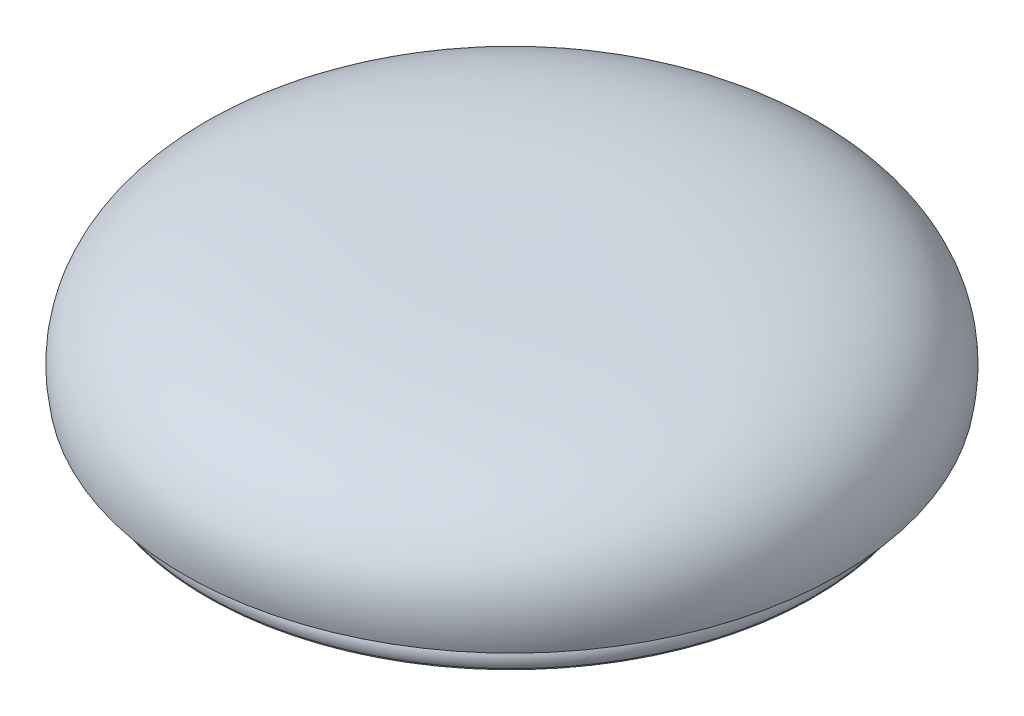
ISO-10303-21;
HEADER;
FILE_DESCRIPTION(('STEP AP214'),'2;1');
FILE_NAME('part.step','',(''),(''),'','','');
FILE_SCHEMA(('AUTOMOTIVE_DESIGN { 1 0 10303 214 1 1 1 1 }'));
ENDSEC;
DATA;
#1=APPLICATION_CONTEXT('core data for automotive mechanical design processes');
#2=APPLICATION_PROTOCOL_DEFINITION('international standard','automotive_design',2000,#1);
#3=PRODUCT_CONTEXT('',#1,'mechanical');
#4=PRODUCT('Part','Part','',(#3));
#5=PRODUCT_RELATED_PRODUCT_CATEGORY('part','',(#4));
#6=PRODUCT_DEFINITION_FORMATION('','',#4);
#7=PRODUCT_DEFINITION_CONTEXT('part definition',#1,'design');
#8=PRODUCT_DEFINITION('design','',#6,#7);
#9=PRODUCT_DEFINITION_SHAPE('','',#8);
#10=(LENGTH_UNIT() NAMED_UNIT(*) SI_UNIT(.MILLI.,.METRE.));
#11=(NAMED_UNIT(*) PLANE_ANGLE_UNIT() SI_UNIT($,.RADIAN.));
#12=(NAMED_UNIT(*) SI_UNIT($,.STERADIAN.) SOLID_ANGLE_UNIT());
#13=UNCERTAINTY_MEASURE_WITH_UNIT(LENGTH_MEASURE(1.E-05),#10,'distance_accuracy_value','');
#14=(GEOMETRIC_REPRESENTATION_CONTEXT(3) GLOBAL_UNCERTAINTY_ASSIGNED_CONTEXT((#13)) GLOBAL_UNIT_ASSIGNED_CONTEXT((#10,
#11,#12)) REPRESENTATION_CONTEXT('',''));
#15=CARTESIAN_POINT('',(0.,0.,0.));
#16=DIRECTION('',(0.,0.,1.));
#17=DIRECTION('',(1.,0.,0.));
#18=AXIS2_PLACEMENT_3D('',#15,#16,#17);
#19=CARTESIAN_POINT('',(0.,22.2492264324853,0.));
#20=DIRECTION('',(0.,-1.,0.));
#21=DIRECTION('',(0.,0.,-1.));
#22=AXIS2_PLACEMENT_3D('',#19,#20,#21);
#23=CYLINDRICAL_SURFACE('',#22,18.);
#24=CARTESIAN_POINT('',(0.,-5.43769082534592,0.));
#25=DIRECTION('',(0.,-1.,0.));
#26=DIRECTION('',(-1.,0.,0.));
#27=AXIS2_PLACEMENT_3D('',#24,#25,#26);
#28=CIRCLE('',#27,18.);
#29=CARTESIAN_POINT('',(-18.,-5.43769082534592,0.));
#30=VERTEX_POINT('',#29);
#31=EDGE_CURVE('E209',#30,#30,#28,.T.);
#32=ORIENTED_EDGE('',*,*,#31,.T.);
#33=EDGE_LOOP('',(#32));
#34=FACE_BOUND('',#33,.T.);
#35=DIRECTION('',(0.,1.,0.));
#36=VECTOR('',#35,1.);
#37=CARTESIAN_POINT('',(-0.99961412307938,-3.73769082534592,17.9722222222223));
#38=LINE('',#37,#36);
#39=CARTESIAN_POINT('',(-0.99961412307938,-3.73769082534592,17.9722222222223));
#40=VERTEX_POINT('',#39);
#41=CARTESIAN_POINT('',(-0.99961412307938,-1.73769082534592,17.9722222222223));
#42=VERTEX_POINT('',#41);
#43=EDGE_CURVE('E147',#40,#42,#38,.T.);
#44=ORIENTED_EDGE('',*,*,#43,.F.);
#45=CARTESIAN_POINT('',(0.,-3.73769082534592,0.));
#46=DIRECTION('',(0.,-1.,0.));
#47=DIRECTION('',(0.,0.,-1.));
#48=AXIS2_PLACEMENT_3D('',#45,#46,#47);
#49=CIRCLE('',#48,18.);
#50=CARTESIAN_POINT('',(0.99961412307938,-3.73769082534592,17.9722222222223));
#51=VERTEX_POINT('',#50);
#52=EDGE_CURVE('E152',#51,#40,#49,.T.);
#53=ORIENTED_EDGE('',*,*,#52,.F.);
#54=DIRECTION('',(0.,1.,0.));
#55=VECTOR('',#54,1.);
#56=CARTESIAN_POINT('',(0.99961412307938,-3.73769082534592,17.9722222222223));
#57=LINE('',#56,#55);
#58=CARTESIAN_POINT('',(0.99961412307938,-1.73769082534592,17.9722222222223));
#59=VERTEX_POINT('',#58);
#60=EDGE_CURVE('E149',#51,#59,#57,.T.);
#61=ORIENTED_EDGE('',*,*,#60,.T.);
#62=CARTESIAN_POINT('',(0.,-1.73769082534592,0.));
#63=DIRECTION('',(0.,-1.,0.));
#64=DIRECTION('',(0.,0.,-1.));
#65=AXIS2_PLACEMENT_3D('',#62,#63,#64);
#66=CIRCLE('',#65,18.);
#67=CARTESIAN_POINT('',(17.9722222222223,-1.73769082534592,0.999614123079378));
#68=VERTEX_POINT('',#67);
#69=EDGE_CURVE('E211',#68,#59,#66,.T.);
#70=ORIENTED_EDGE('',*,*,#69,.F.);
#71=DIRECTION('',(0.,1.,0.));
#72=VECTOR('',#71,1.);
#73=CARTESIAN_POINT('',(17.9722222222223,-3.73769082534592,0.999614123079378));
#74=LINE('',#73,#72);
#75=CARTESIAN_POINT('',(17.9722222222223,-3.73769082534592,0.999614123079378));
#76=VERTEX_POINT('',#75);
#77=EDGE_CURVE('E181',#76,#68,#74,.T.);
#78=ORIENTED_EDGE('',*,*,#77,.F.);
#79=CARTESIAN_POINT('',(0.,-3.73769082534592,0.));
#80=DIRECTION('',(0.,-1.,0.));
#81=DIRECTION('',(0.,0.,-1.));
#82=AXIS2_PLACEMENT_3D('',#79,#80,#81);
#83=CIRCLE('',#82,18.);
#84=CARTESIAN_POINT('',(17.9722222222223,-3.73769082534592,-0.999614123079377));
#85=VERTEX_POINT('',#84);
#86=EDGE_CURVE('E179',#85,#76,#83,.T.);
#87=ORIENTED_EDGE('',*,*,#86,.F.);
#88=DIRECTION('',(0.,1.,0.));
#89=VECTOR('',#88,1.);
#90=CARTESIAN_POINT('',(17.9722222222223,-3.73769082534592,-0.999614123079377));
#91=LINE('',#90,#89);
#92=CARTESIAN_POINT('',(17.9722222222223,-1.73769082534592,-0.999614123079377));
#93=VERTEX_POINT('',#92);
#94=EDGE_CURVE('E185',#85,#93,#91,.T.);
#95=ORIENTED_EDGE('',*,*,#94,.T.);
#96=CARTESIAN_POINT('',(0.999614123079329,-1.73769082534592,-17.9722222222223));
#97=VERTEX_POINT('',#96);
#98=EDGE_CURVE('E210',#97,#93,#66,.T.);
#99=ORIENTED_EDGE('',*,*,#98,.F.);
#100=DIRECTION('',(0.,1.,0.));
#101=VECTOR('',#100,1.);
#102=CARTESIAN_POINT('',(0.999614123079381,-3.73769082534592,-17.9722222222223));
#103=LINE('',#102,#101);
#104=CARTESIAN_POINT('',(0.999614123079381,-3.73769082534592,-17.9722222222223));
#105=VERTEX_POINT('',#104);
#106=EDGE_CURVE('E85',#105,#97,#103,.T.);
#107=ORIENTED_EDGE('',*,*,#106,.F.);
#108=CARTESIAN_POINT('',(0.,-3.73769082534592,0.));
#109=DIRECTION('',(0.,-1.,0.));
#110=DIRECTION('',(0.,0.,-1.));
#111=AXIS2_PLACEMENT_3D('',#108,#109,#110);
#112=CIRCLE('',#111,18.);
#113=CARTESIAN_POINT('',(-0.999614123079381,-3.73769082534592,-17.9722222222223));
#114=VERTEX_POINT('',#113);
#115=EDGE_CURVE('E167',#114,#105,#112,.T.);
#116=ORIENTED_EDGE('',*,*,#115,.F.);
#117=DIRECTION('',(0.,1.,0.));
#118=VECTOR('',#117,1.);
#119=CARTESIAN_POINT('',(-0.999614123079381,-3.73769082534592,-17.9722222222223));
#120=LINE('',#119,#118);
#121=CARTESIAN_POINT('',(-0.999614123079381,-1.73769082534592,-17.9722222222223));
#122=VERTEX_POINT('',#121);
#123=EDGE_CURVE('E171',#114,#122,#120,.T.);
#124=ORIENTED_EDGE('',*,*,#123,.T.);
#125=CARTESIAN_POINT('',(-17.9722222222223,-1.73769082534592,-0.999614123079329));
#126=VERTEX_POINT('',#125);
#127=EDGE_CURVE('E206',#126,#122,#66,.T.);
#128=ORIENTED_EDGE('',*,*,#127,.F.);
#129=DIRECTION('',(0.,1.,0.));
#130=VECTOR('',#129,1.);
#131=CARTESIAN_POINT('',(-17.9722222222223,-3.73769082534592,-0.999614123079378));
#132=LINE('',#131,#130);
#133=CARTESIAN_POINT('',(-17.9722222222223,-3.73769082534592,-0.999614123079378));
#134=VERTEX_POINT('',#133);
#135=EDGE_CURVE('E198',#134,#126,#132,.T.);
#136=ORIENTED_EDGE('',*,*,#135,.F.);
#137=CARTESIAN_POINT('',(0.,-3.73769082534592,0.));
#138=DIRECTION('',(0.,-1.,0.));
#139=DIRECTION('',(0.,0.,-1.));
#140=AXIS2_PLACEMENT_3D('',#137,#138,#139);
#141=CIRCLE('',#140,18.);
#142=CARTESIAN_POINT('',(-17.9722222222223,-3.73769082534592,0.999614123079378));
#143=VERTEX_POINT('',#142);
#144=EDGE_CURVE('E189',#143,#134,#141,.T.);
#145=ORIENTED_EDGE('',*,*,#144,.F.);
#146=DIRECTION('',(0.,1.,0.));
#147=VECTOR('',#146,1.);
#148=CARTESIAN_POINT('',(-17.9722222222223,-3.73769082534592,0.999614123079378));
#149=LINE('',#148,#147);
#150=CARTESIAN_POINT('',(-17.9722222222223,-1.73769082534592,0.999614123079378));
#151=VERTEX_POINT('',#150);
#152=EDGE_CURVE('E194',#143,#151,#149,.T.);
#153=ORIENTED_EDGE('',*,*,#152,.T.);
#154=EDGE_CURVE('E159',#42,#151,#66,.T.);
#155=ORIENTED_EDGE('',*,*,#154,.F.);
#156=EDGE_LOOP('',(#44,#53,#61,#70,#78,#87,#95,#99,#107,#116,#124,#128,#136,#145,#153,#155));
#157=FACE_BOUND('',#156,.T.);
#158=ADVANCED_FACE('F62',(#34,#157),#23,.F.);
#159=CARTESIAN_POINT('',(0.,-1.73769082534592,0.));
#160=DIRECTION('',(0.,-1.,0.));
#161=DIRECTION('',(0.,0.,-1.));
#162=AXIS2_PLACEMENT_3D('',#159,#160,#161);
#163=PLANE('',#162);
#164=CARTESIAN_POINT('',(0.,-1.73769082534592,0.));
#165=DIRECTION('',(0.,-1.,0.));
#166=DIRECTION('',(-1.,0.,0.));
#167=AXIS2_PLACEMENT_3D('',#164,#165,#166);
#168=CIRCLE('',#167,17.);
#169=CARTESIAN_POINT('',(0.,-1.73769082534592,17.));
#170=VERTEX_POINT('',#169);
#171=CARTESIAN_POINT('',(-17.000000000001,-1.73769082534592,0.));
#172=VERTEX_POINT('',#171);
#173=EDGE_CURVE('E200',#170,#172,#168,.T.);
#174=ORIENTED_EDGE('',*,*,#173,.F.);
#175=CARTESIAN_POINT('',(0.,-1.73769082534592,18.));
#176=DIRECTION('',(0.,-1.,0.));
#177=DIRECTION('',(0.,0.,-1.));
#178=AXIS2_PLACEMENT_3D('',#175,#176,#177);
#179=CIRCLE('',#178,0.999999999999013);
#180=EDGE_CURVE('E77',#42,#170,#179,.T.);
#181=ORIENTED_EDGE('',*,*,#180,.F.);
#182=ORIENTED_EDGE('',*,*,#154,.T.);
#183=CARTESIAN_POINT('',(-18.,-1.73769082534592,0.));
#184=DIRECTION('',(0.,-1.,0.));
#185=DIRECTION('',(0.,0.,-1.));
#186=AXIS2_PLACEMENT_3D('',#183,#184,#185);
#187=CIRCLE('',#186,0.999999999999011);
#188=EDGE_CURVE('E284',#151,#172,#187,.F.);
#189=ORIENTED_EDGE('',*,*,#188,.T.);
#190=EDGE_LOOP('',(#174,#181,#182,#189));
#191=FACE_BOUND('',#190,.T.);
#192=ADVANCED_FACE('F251',(#191),#163,.T.);
#193=ORIENTED_EDGE('',*,*,#127,.T.);
#194=CARTESIAN_POINT('',(0.,-1.73769082534592,-18.));
#195=DIRECTION('',(0.,-1.,0.));
#196=DIRECTION('',(0.,0.,-1.));
#197=AXIS2_PLACEMENT_3D('',#194,#195,#196);
#198=CIRCLE('',#197,0.999999999999014);
#199=CARTESIAN_POINT('',(0.,-1.73769082534592,-17.0000000000009));
#200=VERTEX_POINT('',#199);
#201=EDGE_CURVE('E160',#200,#122,#198,.T.);
#202=ORIENTED_EDGE('',*,*,#201,.F.);
#203=EDGE_CURVE('E201',#172,#200,#168,.T.);
#204=ORIENTED_EDGE('',*,*,#203,.F.);
#205=CARTESIAN_POINT('',(-18.,-1.73769082534592,0.));
#206=DIRECTION('',(0.,-1.,0.));
#207=DIRECTION('',(0.,0.,-1.));
#208=AXIS2_PLACEMENT_3D('',#205,#206,#207);
#209=CIRCLE('',#208,0.999999999999011);
#210=EDGE_CURVE('E188',#126,#172,#209,.T.);
#211=ORIENTED_EDGE('',*,*,#210,.F.);
#212=EDGE_LOOP('',(#193,#202,#204,#211));
#213=FACE_BOUND('',#212,.T.);
#214=ADVANCED_FACE('F256',(#213),#163,.T.);
#215=CARTESIAN_POINT('',(17.000000000001,-1.73769082534592,0.));
#216=VERTEX_POINT('',#215);
#217=EDGE_CURVE('E204',#200,#216,#168,.T.);
#218=ORIENTED_EDGE('',*,*,#217,.F.);
#219=EDGE_CURVE('E162',#97,#200,#198,.T.);
#220=ORIENTED_EDGE('',*,*,#219,.F.);
#221=ORIENTED_EDGE('',*,*,#98,.T.);
#222=CARTESIAN_POINT('',(18.,-1.73769082534592,0.));
#223=DIRECTION('',(0.,-1.,0.));
#224=DIRECTION('',(0.,0.,-1.));
#225=AXIS2_PLACEMENT_3D('',#222,#223,#224);
#226=CIRCLE('',#225,0.999999999999011);
#227=EDGE_CURVE('E286',#93,#216,#226,.F.);
#228=ORIENTED_EDGE('',*,*,#227,.T.);
#229=EDGE_LOOP('',(#218,#220,#221,#228));
#230=FACE_BOUND('',#229,.T.);
#231=ADVANCED_FACE('F259',(#230),#163,.T.);
#232=ORIENTED_EDGE('',*,*,#69,.T.);
#233=EDGE_CURVE('E298',#170,#59,#179,.T.);
#234=ORIENTED_EDGE('',*,*,#233,.F.);
#235=EDGE_CURVE('E205',#216,#170,#168,.T.);
#236=ORIENTED_EDGE('',*,*,#235,.F.);
#237=CARTESIAN_POINT('',(18.,-1.73769082534592,0.));
#238=DIRECTION('',(0.,-1.,0.));
#239=DIRECTION('',(0.,0.,-1.));
#240=AXIS2_PLACEMENT_3D('',#237,#238,#239);
#241=CIRCLE('',#240,0.999999999999011);
#242=EDGE_CURVE('E176',#68,#216,#241,.T.);
#243=ORIENTED_EDGE('',*,*,#242,.F.);
#244=EDGE_LOOP('',(#232,#234,#236,#243));
#245=FACE_BOUND('',#244,.T.);
#246=ADVANCED_FACE('F263',(#245),#163,.T.);
#247=CARTESIAN_POINT('',(0.,22.2492264324853,0.));
#248=DIRECTION('',(0.,-1.,0.));
#249=DIRECTION('',(0.,0.,-1.));
#250=AXIS2_PLACEMENT_3D('',#247,#248,#249);
#251=CYLINDRICAL_SURFACE('',#250,19.);
#252=CARTESIAN_POINT('',(0.,-5.37965508452938,0.));
#253=DIRECTION('',(0.,1.,0.));
#254=DIRECTION('',(0.,0.,1.));
#255=AXIS2_PLACEMENT_3D('',#252,#253,#254);
#256=CIRCLE('',#255,19.);
#257=CARTESIAN_POINT('',(0.,-5.37965508452938,19.));
#258=VERTEX_POINT('',#257);
#259=EDGE_CURVE('E288',#258,#258,#256,.T.);
#260=ORIENTED_EDGE('',*,*,#259,.F.);
#261=EDGE_LOOP('',(#260));
#262=FACE_BOUND('',#261,.T.);
#263=CARTESIAN_POINT('',(0.,-5.43769082534592,0.));
#264=DIRECTION('',(0.,-1.,0.));
#265=DIRECTION('',(0.,0.,-1.));
#266=AXIS2_PLACEMENT_3D('',#263,#264,#265);
#267=CIRCLE('',#266,19.);
#268=CARTESIAN_POINT('',(0.,-5.43769082534592,-19.));
#269=VERTEX_POINT('',#268);
#270=EDGE_CURVE('E214',#269,#269,#267,.T.);
#271=ORIENTED_EDGE('',*,*,#270,.F.);
#272=EDGE_LOOP('',(#271));
#273=FACE_BOUND('',#272,.T.);
#274=ADVANCED_FACE('F247',(#262,#273),#251,.T.);
#275=CARTESIAN_POINT('',(0.,-5.43769082534592,0.));
#276=DIRECTION('',(0.,-1.,0.));
#277=DIRECTION('',(0.,0.,-1.));
#278=AXIS2_PLACEMENT_3D('',#275,#276,#277);
#279=PLANE('',#278);
#280=ORIENTED_EDGE('',*,*,#270,.T.);
#281=EDGE_LOOP('',(#280));
#282=FACE_BOUND('',#281,.T.);
#283=ORIENTED_EDGE('',*,*,#31,.F.);
#284=EDGE_LOOP('',(#283));
#285=FACE_BOUND('',#284,.T.);
#286=ADVANCED_FACE('F262',(#282,#285),#279,.T.);
#287=CARTESIAN_POINT('',(0.,22.3666566954747,0.));
#288=DIRECTION('',(0.,-1.,0.));
#289=DIRECTION('',(0.,0.,-1.));
#290=AXIS2_PLACEMENT_3D('',#287,#288,#289);
#291=CYLINDRICAL_SURFACE('',#290,17.);
#292=ORIENTED_EDGE('',*,*,#203,.T.);
#293=ORIENTED_EDGE('',*,*,#217,.T.);
#294=ORIENTED_EDGE('',*,*,#235,.T.);
#295=ORIENTED_EDGE('',*,*,#173,.T.);
#296=EDGE_LOOP('',(#292,#293,#294,#295));
#297=FACE_BOUND('',#296,.T.);
#298=CARTESIAN_POINT('',(17.000000000001,1.68801968939402,0.));
#299=CARTESIAN_POINT('',(17.0000035560327,1.68801969847126,-0.477618703130306));
#300=CARTESIAN_POINT('',(16.9798639703442,1.68796677671379,-0.955180704728664));
#301=CARTESIAN_POINT('',(16.8994438615228,1.68775542570378,-1.90707379360624));
#302=CARTESIAN_POINT('',(16.8391527782984,1.68759696869482,-2.38140399773917));
#303=CARTESIAN_POINT('',(16.6787647399731,1.68717535459705,-3.32378711408135));
#304=CARTESIAN_POINT('',(16.5786250015744,1.68691208497658,-3.79183271871262));
#305=CARTESIAN_POINT('',(16.3392253396706,1.68628252234734,-4.71787520295034));
#306=CARTESIAN_POINT('',(16.1999655575279,1.68591622971085,-5.17587211886185));
#307=CARTESIAN_POINT('',(15.9625717460996,1.68529159724498,-5.85264861990842));
#308=CARTESIAN_POINT('',(15.8786963576871,1.68507087147147,-6.07652298972539));
#309=CARTESIAN_POINT('',(15.701606089634,1.68460475578768,-6.520480516648));
#310=CARTESIAN_POINT('',(15.6083936035454,1.68435937219835,-6.74056462851361));
#311=CARTESIAN_POINT('',(15.3149331686086,1.68358667556507,-7.3946701025648));
#312=CARTESIAN_POINT('',(15.1008497491929,1.68302278379005,-7.8225802073543));
#313=CARTESIAN_POINT('',(14.6374775243,1.68180166481787,-8.6586785719361));
#314=CARTESIAN_POINT('',(14.3881977051624,1.68114446144477,-9.06687183023773));
#315=CARTESIAN_POINT('',(13.8561350581515,1.67974093715539,-9.86082392903177));
#316=CARTESIAN_POINT('',(13.573352361296,1.67899461658762,-10.246582857248));
#317=CARTESIAN_POINT('',(12.9762686073923,1.67741780540806,-10.992946949799));
#318=CARTESIAN_POINT('',(12.6619641406906,1.67658730569065,-11.3535493858321));
#319=CARTESIAN_POINT('',(12.0040943941885,1.67484779774303,-12.0469966837345));
#320=CARTESIAN_POINT('',(11.6605290847071,1.67393878943319,-12.3798415174469));
#321=CARTESIAN_POINT('',(10.9465670268755,1.67204838495584,-13.0154179890461));
#322=CARTESIAN_POINT('',(10.5761692343942,1.67106698597137,-13.3181484540052));
#323=CARTESIAN_POINT('',(9.81118737323579,1.66903850545577,-13.8913295004379));
#324=CARTESIAN_POINT('',(9.41660330923816,1.66799142393735,-14.1617800881571));
#325=CARTESIAN_POINT('',(8.60606044000102,1.6658387494576,-14.668474704021));
#326=CARTESIAN_POINT('',(8.19010196163828,1.66473315739107,-14.9047192550644));
#327=CARTESIAN_POINT('',(7.33976191988684,1.66247103800059,-15.3413272274315));
#328=CARTESIAN_POINT('',(6.90538035612162,1.66131451067561,-15.5416906480219));
#329=CARTESIAN_POINT('',(6.02128323783003,1.65895850540835,-15.905111547572));
#330=CARTESIAN_POINT('',(5.57156771410392,1.65775902755235,-16.0681691014604));
#331=CARTESIAN_POINT('',(4.65999903477512,1.65532544154648,-16.3558195776524));
#332=CARTESIAN_POINT('',(4.19814587916371,1.65409133339659,-16.4804124999284));
#333=CARTESIAN_POINT('',(3.26558302927922,1.65159709119738,-16.6902484941078));
#334=CARTESIAN_POINT('',(2.79487328990402,1.65033695701552,-16.7754913655646));
#335=CARTESIAN_POINT('',(1.84794602254355,1.64779951045529,-16.906020311199));
#336=CARTESIAN_POINT('',(1.37172849454761,1.64652219807688,-16.951306385299));
#337=CARTESIAN_POINT('',(0.417172123857912,1.64395941159639,-17.0015997433002));
#338=CARTESIAN_POINT('',(-0.0611667150292667,1.64267393750894,-17.0066070994502));
#339=CARTESIAN_POINT('',(-1.01656587244187,1.64010394899662,-16.9763076147103));
#340=CARTESIAN_POINT('',(-1.49362619096807,1.63881943457175,-16.9410007738448));
#341=CARTESIAN_POINT('',(-2.44307770156356,1.63626053290186,-16.8303237850547));
#342=CARTESIAN_POINT('',(-2.9154688839221,1.6349861456779,-16.7549535538252));
#343=CARTESIAN_POINT('',(-3.85222269932379,1.6324566507773,-16.5646855593774));
#344=CARTESIAN_POINT('',(-4.31658533234435,1.63120154310071,-16.4497877960479));
#345=CARTESIAN_POINT('',(-5.23398119175963,1.62871966888791,-16.1812814335784));
#346=CARTESIAN_POINT('',(-5.68701440616107,1.62749290238171,-16.0276727934613));
#347=CARTESIAN_POINT('',(-6.57853010815657,1.62507661877146,-15.6828367856561));
#348=CARTESIAN_POINT('',(-7.01701259575735,1.62388710166739,-15.4916094179854));
#349=CARTESIAN_POINT('',(-7.87630908699545,1.62155400148361,-15.0728956369643));
#350=CARTESIAN_POINT('',(-8.29712310655447,1.6204104183625,-14.8454092562892));
#351=CARTESIAN_POINT('',(-9.11809132101079,1.61817757605692,-14.3557945963249));
#352=CARTESIAN_POINT('',(-9.51824551592173,1.61708831687242,-14.0936663170586));
#353=CARTESIAN_POINT('',(-10.2950490314526,1.61497215554116,-13.5366315311186));
#354=CARTESIAN_POINT('',(-10.671698361781,1.61394525336866,-13.2417250379838));
#355=CARTESIAN_POINT('',(-11.3988145386519,1.61196141337179,-12.6212303289463));
#356=CARTESIAN_POINT('',(-11.7492813852546,1.61100447554725,-12.295642113114));
#357=CARTESIAN_POINT('',(-12.4215400860326,1.60916768774228,-11.6160995508293));
#358=CARTESIAN_POINT('',(-12.7433320131068,1.60828783756588,-11.2621452764949));
#359=CARTESIAN_POINT('',(-13.3559540900622,1.60661179582792,-10.5283862660106));
#360=CARTESIAN_POINT('',(-13.6467842399801,1.60581560426628,-10.1485815298914));
#361=CARTESIAN_POINT('',(-14.1954151240367,1.6043128506926,-9.36582172960764));
#362=CARTESIAN_POINT('',(-14.4532158543395,1.60360628869096,-8.9628666627546));
#363=CARTESIAN_POINT('',(-14.9339550058143,1.60228811019733,-8.13667101626255));
#364=CARTESIAN_POINT('',(-15.1568934270696,1.60167649370511,-7.71343043667208));
#365=CARTESIAN_POINT('',(-15.5663222051436,1.6005528237062,-6.84967435648679));
#366=CARTESIAN_POINT('',(-15.7528126959416,1.60004076983353,-6.40915891939996));
#367=CARTESIAN_POINT('',(-16.0880207674756,1.59912009534597,-5.51398346652027));
#368=CARTESIAN_POINT('',(-16.2367383483028,1.59871147473084,-5.05932345076155));
#369=CARTESIAN_POINT('',(-16.4953432718668,1.59800076426986,-4.13909123931168));
#370=CARTESIAN_POINT('',(-16.6052306169242,1.59769867441765,-3.67351904427267));
#371=CARTESIAN_POINT('',(-16.7853938261149,1.5972033184664,-2.73477240539813));
#372=CARTESIAN_POINT('',(-16.8556696903109,1.59701005236718,-2.26159796157464));
#373=CARTESIAN_POINT('',(-16.9561101562279,1.59673381338371,-1.31101223395397));
#374=CARTESIAN_POINT('',(-16.9862748759139,1.5966508401751,-0.833600962621239));
#375=CARTESIAN_POINT('',(-17.0062789784362,1.59659581657889,0.122065679512847));
#376=CARTESIAN_POINT('',(-16.9961183613596,1.59662376619105,0.600321050312382));
#377=CARTESIAN_POINT('',(-16.9355440270199,1.59679037596599,1.55427579388588));
#378=CARTESIAN_POINT('',(-16.8851303082593,1.59692903613289,2.02997516656476));
#379=CARTESIAN_POINT('',(-16.7444081886993,1.59731601258179,2.97543595357094));
#380=CARTESIAN_POINT('',(-16.6540997878947,1.59756432886379,3.44519736789748));
#381=CARTESIAN_POINT('',(-16.4342304498382,1.59816873137521,4.37544212505485));
#382=CARTESIAN_POINT('',(-16.3046695454206,1.59852481751446,4.83592547564635));
#383=CARTESIAN_POINT('',(-16.0072162924565,1.59934205828937,5.74434075918896));
#384=CARTESIAN_POINT('',(-15.8393239439504,1.59980321292492,6.19227269215335));
#385=CARTESIAN_POINT('',(-15.4664014613059,1.6008270989053,7.07240057373202));
#386=CARTESIAN_POINT('',(-15.2613713319272,1.60138983023711,7.50459652436311));
#387=CARTESIAN_POINT('',(-14.8156309350452,1.60261261774547,8.35017987369867));
#388=CARTESIAN_POINT('',(-14.5749206674923,1.60327267392216,8.76356727237707));
#389=CARTESIAN_POINT('',(-14.0595309423248,1.6046851388784,9.56859520249327));
#390=CARTESIAN_POINT('',(-13.7848514351376,1.60543754779275,9.96023570219385));
#391=CARTESIAN_POINT('',(-13.2034763347246,1.60702906529286,10.7189848872404));
#392=CARTESIAN_POINT('',(-12.8967807414752,1.6078681738787,11.0860935725682));
#393=CARTESIAN_POINT('',(-12.2535537707513,1.60962681027434,11.7931693946497));
#394=CARTESIAN_POINT('',(-11.9170223808404,1.61054633811766,12.1331365200896));
#395=CARTESIAN_POINT('',(-11.2165164705066,1.6124589559907,12.7835121352416));
#396=CARTESIAN_POINT('',(-10.8525419499964,1.61345204602065,13.0939206248594));
#397=CARTESIAN_POINT('',(-10.0997360445694,1.61550441852825,13.6829732733962));
#398=CARTESIAN_POINT('',(-9.71090456899423,1.61656370124732,13.9616173164535));
#399=CARTESIAN_POINT('',(-8.91115031396911,1.61874062588035,14.4851588090743));
#400=CARTESIAN_POINT('',(-8.50022753448705,1.61985826779439,14.7300562585889));
#401=CARTESIAN_POINT('',(-7.65921252447484,1.62214368858003,15.1843632908661));
#402=CARTESIAN_POINT('',(-7.22912031390487,1.62331146739943,15.3937729105795));
#403=CARTESIAN_POINT('',(-6.35282372537073,1.62568861613057,15.7756158565104));
#404=CARTESIAN_POINT('',(-5.90661934739343,1.62689798604236,15.9480491826978));
#405=CARTESIAN_POINT('',(-5.00126922353989,1.62934951668789,16.2547141602841));
#406=CARTESIAN_POINT('',(-4.54212343708238,1.63059167752447,16.3889456918763));
#407=CARTESIAN_POINT('',(-3.61415607421394,1.63309979217255,16.6182520766955));
#408=CARTESIAN_POINT('',(-3.14533449776813,1.63436574598414,16.7133269297814));
#409=CARTESIAN_POINT('',(-2.20134772019503,1.63691233417107,16.8636441852569));
#410=CARTESIAN_POINT('',(-1.72618250754668,1.63819296857308,16.9188865152944));
#411=CARTESIAN_POINT('',(-0.77288742337267,1.64075974705306,16.989145711309));
#412=CARTESIAN_POINT('',(-0.294757551843533,1.64204589113104,17.0041625772391));
#413=CARTESIAN_POINT('',(0.661067747782621,1.64461453459899,16.9938640837356));
#414=CARTESIAN_POINT('',(1.13876317578512,1.64589703398816,16.9685487155292));
#415=CARTESIAN_POINT('',(2.09032336448709,1.64844931110112,16.877765708872));
#416=CARTESIAN_POINT('',(2.5641881251755,1.64971908882487,16.8122980703052));
#417=CARTESIAN_POINT('',(3.50471904458815,1.65223699060606,16.6416757708515));
#418=CARTESIAN_POINT('',(3.97138518872329,1.65348511461962,16.5365210295437));
#419=CARTESIAN_POINT('',(4.89420014641842,1.65595097332731,16.2872721191057));
#420=CARTESIAN_POINT('',(5.35034896017974,1.65716870802203,16.143177950721));
#421=CARTESIAN_POINT('',(6.24889460716698,1.65956533792966,15.8170715580898));
#422=CARTESIAN_POINT('',(6.691291186818,1.66074423242643,15.6350586351425));
#423=CARTESIAN_POINT('',(7.55917828210312,1.66305500002243,15.2344104227365));
#424=CARTESIAN_POINT('',(7.98466879442145,1.66418687311244,15.0157751260952));
#425=CARTESIAN_POINT('',(8.81570256713261,1.6663957637823,14.5434454677284));
#426=CARTESIAN_POINT('',(9.22124660335612,1.66747278349576,14.2897524710587));
#427=CARTESIAN_POINT('',(10.0095208355183,1.66956463490669,13.7491059884421));
#428=CARTESIAN_POINT('',(10.3922510546206,1.6705794666673,13.4621525362664));
#429=CARTESIAN_POINT('',(11.1321401480099,1.67253992828755,12.8570530627176));
#430=CARTESIAN_POINT('',(11.4893017932209,1.67348556564618,12.5389104302673));
#431=CARTESIAN_POINT('',(12.1755504037594,1.6753013167598,11.8736840753429));
#432=CARTESIAN_POINT('',(12.5046372592777,1.67617143021937,11.5266002396813));
#433=CARTESIAN_POINT('',(13.1325198179181,1.67783057931597,10.8058017129635));
#434=CARTESIAN_POINT('',(13.4313077778869,1.67861959422823,10.4320802557703));
#435=CARTESIAN_POINT('',(13.8549937345396,1.67973783676188,9.85374608017186));
#436=CARTESIAN_POINT('',(13.9921446375889,1.68009971725569,9.65800130501569));
#437=CARTESIAN_POINT('',(14.2581096954986,1.68080130170503,9.26085516464786));
#438=CARTESIAN_POINT('',(14.3869217091555,1.68114099996496,9.05945236549431));
#439=CARTESIAN_POINT('',(14.7605157174432,1.68212599374806,8.44723113037578));
#440=CARTESIAN_POINT('',(14.9924186420366,1.68273709053973,8.02845042290327));
#441=CARTESIAN_POINT('',(15.4200682702906,1.68386356783934,7.17288635410876));
#442=CARTESIAN_POINT('',(15.6158148433743,1.6843789480016,6.73610292777784));
#443=CARTESIAN_POINT('',(15.9696121141056,1.68531016730999,5.84804600243462));
#444=CARTESIAN_POINT('',(16.1277031242352,1.68572611290839,5.39678859147626));
#445=CARTESIAN_POINT('',(16.4052852571913,1.68645627169558,4.48271883316863));
#446=CARTESIAN_POINT('',(16.5247865225851,1.6867705116158,4.01990955651091));
#447=CARTESIAN_POINT('',(16.7492548269506,1.68736067990567,2.96952812107536));
#448=CARTESIAN_POINT('',(16.843204603528,1.68760761433855,2.37956900423363));
#449=CARTESIAN_POINT('',(16.9685749694665,1.68793711341438,1.19304378016206));
#450=CARTESIAN_POINT('',(16.9999955590243,1.68801967805784,0.596477672953009));
#451=CARTESIAN_POINT('',(17.000000000001,1.68801968939402,0.));
#452=B_SPLINE_CURVE_WITH_KNOTS('',3,(#298,#299,#300,#301,#302,#303,#304,#305,#306,#307,#308,
#309,#310,#311,#312,#313,#314,#315,#316,#317,#318,#319,#320,#321,#322,#323,#324,#325,#326,#327,
#328,#329,#330,#331,#332,#333,#334,#335,#336,#337,#338,#339,#340,#341,#342,#343,#344,#345,#346,
#347,#348,#349,#350,#351,#352,#353,#354,#355,#356,#357,#358,#359,#360,#361,#362,#363,#364,#365,
#366,#367,#368,#369,#370,#371,#372,#373,#374,#375,#376,#377,#378,#379,#380,#381,#382,#383,#384,
#385,#386,#387,#388,#389,#390,#391,#392,#393,#394,#395,#396,#397,#398,#399,#400,#401,#402,#403,
#404,#405,#406,#407,#408,#409,#410,#411,#412,#413,#414,#415,#416,#417,#418,#419,#420,#421,#422,
#423,#424,#425,#426,#427,#428,#429,#430,#431,#432,#433,#434,#435,#436,#437,#438,#439,#440,#441,
#442,#443,#444,#445,#446,#447,#448,#449,#450,#451),.UNSPECIFIED.,.T.,.F.,(4,2,2,2,2,2,2,2,2,2,2,
2,2,2,2,2,2,2,2,2,2,2,2,2,2,2,2,2,2,2,2,2,2,2,2,2,2,2,2,2,2,2,2,2,2,2,2,2,2,2,2,2,2,2,2,2,2,2,2,
2,2,2,2,2,2,2,2,2,2,2,2,2,2,2,2,2,4),(0.,1.43233622193139,2.86504930597358,4.29930478311426,
5.7335550775591,6.45058418611083,7.16742995337431,8.60100865369337,10.0342219925706,
11.4674297268493,12.9007926561942,14.3341570395023,15.767577229238,17.2009971416383,
18.6343951394122,20.067793166482,21.5011883145549,22.9345834636575,24.3679859142982,
25.8013883677176,27.2347882500104,28.6681881314351,30.1015909933782,31.5349938593542,
32.9683982426603,34.4018026253031,35.8352057162248,37.2686088062006,38.7020113041182,
40.1354137987434,41.5688126491955,43.0022114979532,44.4356105131809,45.8690095249786,
47.3024032676298,48.7357970068216,50.169190660349,51.6025843116059,53.0359737473129,
54.4693631799251,55.9027526658605,57.3361421519799,58.7695304390877,60.2029187246811,
61.6363068265638,63.0696949304329,64.5030851261185,65.9364753228604,67.3698661170875,
68.8032569158777,70.2366529428265,71.6700489718557,73.1034435083946,74.5368380461011,
75.9702370791019,77.403636117268,78.837037759068,80.2704394025443,81.7038413578042,
83.1372433172067,84.5706481812366,86.0040530178272,87.4374842690467,88.8709158014025,
90.3042915353778,91.7376658139796,93.1708845186874,94.6041088288977,96.0376984941718,
96.7545497436318,97.4715843371217,98.9058409578802,100.340102758281,101.772822126006,
103.205164624112,104.993948383273,106.782732136808),.UNSPECIFIED.);
#453=CARTESIAN_POINT('',(17.000000000001,1.68801968939402,0.));
#454=VERTEX_POINT('',#453);
#455=EDGE_CURVE('E278',#454,#454,#452,.T.);
#456=ORIENTED_EDGE('',*,*,#455,.T.);
#457=EDGE_LOOP('',(#456));
#458=FACE_BOUND('',#457,.T.);
#459=ADVANCED_FACE('F266',(#297,#458),#291,.F.);
#460=CARTESIAN_POINT('',(16.759025608657,-7.81663580701133,0.));
#461=CARTESIAN_POINT('',(17.4682776131375,-7.65051693604975,0.));
#462=CARTESIAN_POINT('',(19.9384184993936,-5.64091020102,0.));
#463=CARTESIAN_POINT('',(21.575238992465,-0.747313228433289,0.));
#464=CARTESIAN_POINT('',(17.6690688243442,5.03867900532571,0.));
#465=CARTESIAN_POINT('',(2.39445208411675,4.5623091746548,0.));
#466=CARTESIAN_POINT('',(0.0827023660781402,4.56230917465408,0.));
#467=B_SPLINE_CURVE_WITH_KNOTS('',3,(#460,#461,#462,#463,#464,#465,#466),.UNSPECIFIED.,.F.,.F.,
(4,1,1,1,4),(0.0045130235203184,0.060344305065676,0.102248358368729,0.311975325291504,
0.500299922629565),.UNSPECIFIED.);
#468=CARTESIAN_POINT('',(0.0827023660781422,-9.95846739714006,0.));
#469=DIRECTION('',(0.,-1.,0.));
#470=AXIS1_PLACEMENT('',#468,#469);
#471=SURFACE_OF_REVOLUTION('',#467,#470);
#472=OFFSET_SURFACE('',#471,1.,.F.);
#473=CARTESIAN_POINT('',(0.0827023660784516,3.56230917465408,0.));
#474=VERTEX_POINT('',#473);
#475=VERTEX_LOOP('',#474);
#476=FACE_BOUND('',#475,.T.);
#477=ORIENTED_EDGE('',*,*,#455,.F.);
#478=EDGE_LOOP('',(#477));
#479=FACE_BOUND('',#478,.T.);
#480=ADVANCED_FACE('F232',(#476,#479),#472,.T.);
#481=CARTESIAN_POINT('',(-18.,-3.73769082534592,0.));
#482=DIRECTION('',(0.,1.,0.));
#483=DIRECTION('',(0.,0.,1.));
#484=AXIS2_PLACEMENT_3D('',#481,#482,#483);
#485=CYLINDRICAL_SURFACE('',#484,0.999999999999011);
#486=ORIENTED_EDGE('',*,*,#210,.T.);
#487=ORIENTED_EDGE('',*,*,#188,.F.);
#488=ORIENTED_EDGE('',*,*,#152,.F.);
#489=CARTESIAN_POINT('',(-18.,-3.73769082534592,0.));
#490=DIRECTION('',(0.,-1.,0.));
#491=DIRECTION('',(0.,0.,-1.));
#492=AXIS2_PLACEMENT_3D('',#489,#490,#491);
#493=CIRCLE('',#492,0.999999999999011);
#494=EDGE_CURVE('E192',#134,#143,#493,.T.);
#495=ORIENTED_EDGE('',*,*,#494,.F.);
#496=ORIENTED_EDGE('',*,*,#135,.T.);
#497=EDGE_LOOP('',(#486,#487,#488,#495,#496));
#498=FACE_BOUND('',#497,.T.);
#499=ADVANCED_FACE('F275',(#498),#485,.T.);
#500=CARTESIAN_POINT('',(-9.,-3.73769082534592,0.));
#501=DIRECTION('',(0.,-1.,0.));
#502=DIRECTION('',(0.,0.,-1.));
#503=AXIS2_PLACEMENT_3D('',#500,#501,#502);
#504=PLANE('',#503);
#505=ORIENTED_EDGE('',*,*,#144,.T.);
#506=ORIENTED_EDGE('',*,*,#494,.T.);
#507=EDGE_LOOP('',(#505,#506));
#508=FACE_BOUND('',#507,.T.);
#509=ADVANCED_FACE('F314',(#508),#504,.T.);
#510=CARTESIAN_POINT('',(18.,-3.73769082534592,0.));
#511=DIRECTION('',(0.,1.,0.));
#512=DIRECTION('',(0.,0.,1.));
#513=AXIS2_PLACEMENT_3D('',#510,#511,#512);
#514=CYLINDRICAL_SURFACE('',#513,0.999999999999011);
#515=ORIENTED_EDGE('',*,*,#242,.T.);
#516=ORIENTED_EDGE('',*,*,#227,.F.);
#517=ORIENTED_EDGE('',*,*,#94,.F.);
#518=CARTESIAN_POINT('',(18.,-3.73769082534592,0.));
#519=DIRECTION('',(0.,-1.,0.));
#520=DIRECTION('',(0.,0.,-1.));
#521=AXIS2_PLACEMENT_3D('',#518,#519,#520);
#522=CIRCLE('',#521,0.999999999999011);
#523=EDGE_CURVE('E177',#76,#85,#522,.T.);
#524=ORIENTED_EDGE('',*,*,#523,.F.);
#525=ORIENTED_EDGE('',*,*,#77,.T.);
#526=EDGE_LOOP('',(#515,#516,#517,#524,#525));
#527=FACE_BOUND('',#526,.T.);
#528=ADVANCED_FACE('F333',(#527),#514,.T.);
#529=CARTESIAN_POINT('',(9.,-3.73769082534592,0.));
#530=DIRECTION('',(0.,-1.,0.));
#531=DIRECTION('',(0.,0.,-1.));
#532=AXIS2_PLACEMENT_3D('',#529,#530,#531);
#533=PLANE('',#532);
#534=ORIENTED_EDGE('',*,*,#523,.T.);
#535=ORIENTED_EDGE('',*,*,#86,.T.);
#536=EDGE_LOOP('',(#534,#535));
#537=FACE_BOUND('',#536,.T.);
#538=ADVANCED_FACE('F337',(#537),#533,.T.);
#539=CARTESIAN_POINT('',(0.,-3.73769082534592,-18.));
#540=DIRECTION('',(0.,1.,0.));
#541=DIRECTION('',(0.,0.,1.));
#542=AXIS2_PLACEMENT_3D('',#539,#540,#541);
#543=CYLINDRICAL_SURFACE('',#542,0.999999999999014);
#544=ORIENTED_EDGE('',*,*,#219,.T.);
#545=ORIENTED_EDGE('',*,*,#201,.T.);
#546=ORIENTED_EDGE('',*,*,#123,.F.);
#547=CARTESIAN_POINT('',(0.,-3.73769082534592,-18.));
#548=DIRECTION('',(0.,-1.,0.));
#549=DIRECTION('',(0.,0.,-1.));
#550=AXIS2_PLACEMENT_3D('',#547,#548,#549);
#551=CIRCLE('',#550,0.999999999999014);
#552=EDGE_CURVE('E170',#105,#114,#551,.T.);
#553=ORIENTED_EDGE('',*,*,#552,.F.);
#554=ORIENTED_EDGE('',*,*,#106,.T.);
#555=EDGE_LOOP('',(#544,#545,#546,#553,#554));
#556=FACE_BOUND('',#555,.T.);
#557=ADVANCED_FACE('F319',(#556),#543,.T.);
#558=CARTESIAN_POINT('',(0.,-3.73769082534592,-9.));
#559=DIRECTION('',(0.,-1.,0.));
#560=DIRECTION('',(0.,0.,-1.));
#561=AXIS2_PLACEMENT_3D('',#558,#559,#560);
#562=PLANE('',#561);
#563=ORIENTED_EDGE('',*,*,#115,.T.);
#564=ORIENTED_EDGE('',*,*,#552,.T.);
#565=EDGE_LOOP('',(#563,#564));
#566=FACE_BOUND('',#565,.T.);
#567=ADVANCED_FACE('F346',(#566),#562,.T.);
#568=CARTESIAN_POINT('',(0.,-3.73769082534592,18.));
#569=DIRECTION('',(0.,1.,0.));
#570=DIRECTION('',(0.,0.,1.));
#571=AXIS2_PLACEMENT_3D('',#568,#569,#570);
#572=CYLINDRICAL_SURFACE('',#571,0.999999999999013);
#573=ORIENTED_EDGE('',*,*,#180,.T.);
#574=ORIENTED_EDGE('',*,*,#233,.T.);
#575=ORIENTED_EDGE('',*,*,#60,.F.);
#576=CARTESIAN_POINT('',(0.,-3.73769082534592,18.));
#577=DIRECTION('',(0.,-1.,0.));
#578=DIRECTION('',(0.,0.,-1.));
#579=AXIS2_PLACEMENT_3D('',#576,#577,#578);
#580=CIRCLE('',#579,0.999999999999013);
#581=EDGE_CURVE('E143',#40,#51,#580,.T.);
#582=ORIENTED_EDGE('',*,*,#581,.F.);
#583=ORIENTED_EDGE('',*,*,#43,.T.);
#584=EDGE_LOOP('',(#573,#574,#575,#582,#583));
#585=FACE_BOUND('',#584,.T.);
#586=ADVANCED_FACE('F145',(#585),#572,.T.);
#587=CARTESIAN_POINT('',(0.,-3.73769082534592,9.));
#588=DIRECTION('',(0.,-1.,0.));
#589=DIRECTION('',(0.,0.,-1.));
#590=AXIS2_PLACEMENT_3D('',#587,#588,#589);
#591=PLANE('',#590);
#592=ORIENTED_EDGE('',*,*,#52,.T.);
#593=ORIENTED_EDGE('',*,*,#581,.T.);
#594=EDGE_LOOP('',(#592,#593));
#595=FACE_BOUND('',#594,.T.);
#596=ADVANCED_FACE('F154',(#595),#591,.T.);
#597=CARTESIAN_POINT('',(0.,-4.93580402302098,0.));
#598=DIRECTION('',(0.,1.,0.));
#599=DIRECTION('',(0.,0.,1.));
#600=AXIS2_PLACEMENT_3D('',#597,#598,#599);
#601=TOROIDAL_SURFACE('',#600,18.103899427967,1.);
#602=CARTESIAN_POINT('',(0.,-4.49195296151258,0.));
#603=DIRECTION('',(0.,-1.,0.));
#604=DIRECTION('',(0.,0.,-1.));
#605=AXIS2_PLACEMENT_3D('',#602,#603,#604);
#606=CIRCLE('',#605,19.);
#607=CARTESIAN_POINT('',(0.,-4.49195296151258,-19.));
#608=VERTEX_POINT('',#607);
#609=EDGE_CURVE('E70',#608,#608,#606,.T.);
#610=ORIENTED_EDGE('',*,*,#609,.T.);
#611=EDGE_LOOP('',(#610));
#612=FACE_BOUND('',#611,.T.);
#613=ORIENTED_EDGE('',*,*,#259,.T.);
#614=EDGE_LOOP('',(#613));
#615=FACE_BOUND('',#614,.T.);
#616=ADVANCED_FACE('F244',(#612,#615),#601,.T.);
#617=CARTESIAN_POINT('',(0.,-3.43769082534592,0.));
#618=DIRECTION('',(0.,-1.,0.));
#619=DIRECTION('',(0.,0.,-1.));
#620=AXIS2_PLACEMENT_3D('',#617,#618,#619);
#621=CIRCLE('',#620,19.);
#622=CARTESIAN_POINT('',(0.,-3.43769082534592,-19.));
#623=VERTEX_POINT('',#622);
#624=EDGE_CURVE('E13',#623,#623,#621,.F.);
#625=ORIENTED_EDGE('',*,*,#624,.F.);
#626=EDGE_LOOP('',(#625));
#627=FACE_BOUND('',#626,.T.);
#628=ORIENTED_EDGE('',*,*,#609,.F.);
#629=EDGE_LOOP('',(#628));
#630=FACE_BOUND('',#629,.T.);
#631=ADVANCED_FACE('F237',(#627,#630),#251,.T.);
#632=CARTESIAN_POINT('',(16.6014959375679,-7.83707612005169,0.));
#633=CARTESIAN_POINT('',(17.2359978572225,-7.83707612005169,0.));
#634=CARTESIAN_POINT('',(19.9143927591932,-5.71273987935461,0.));
#635=CARTESIAN_POINT('',(21.575238992465,-0.747313228433289,0.));
#636=CARTESIAN_POINT('',(17.6690688243442,5.03867900532571,0.));
#637=CARTESIAN_POINT('',(2.39445208411675,4.5623091746548,0.));
#638=CARTESIAN_POINT('',(0.0827023660781402,4.56230917465408,0.));
#639=B_SPLINE_CURVE_WITH_KNOTS('',3,(#632,#633,#634,#635,#636,#637,#638),.UNSPECIFIED.,.F.,.F.,
(4,1,1,1,4),(0.,0.060344305065676,0.102248358368729,0.311975325291504,0.500299922629565),.UNSPECIFIED.);
#640=CARTESIAN_POINT('',(0.0827023660781422,-9.95846739714006,0.));
#641=DIRECTION('',(0.,-1.,0.));
#642=AXIS1_PLACEMENT('',#640,#641);
#643=SURFACE_OF_REVOLUTION('',#639,#642);
#644=CARTESIAN_POINT('',(0.0827023660781415,-3.43769082534593,0.));
#645=DIRECTION('',(0.,-1.,0.));
#646=DIRECTION('',(1.,0.,0.));
#647=AXIS2_PLACEMENT_3D('',#644,#645,#646);
#648=CIRCLE('',#647,20.5);
#649=CARTESIAN_POINT('',(20.5827023660781,-3.43769082534592,0.));
#650=VERTEX_POINT('',#649);
#651=EDGE_CURVE('E217',#650,#650,#648,.T.);
#652=ORIENTED_EDGE('',*,*,#651,.F.);
#653=EDGE_LOOP('',(#652));
#654=FACE_BOUND('',#653,.T.);
#655=CARTESIAN_POINT('',(0.0827023660781405,4.56230917465408,0.));
#656=VERTEX_POINT('',#655);
#657=VERTEX_LOOP('',#656);
#658=FACE_BOUND('',#657,.T.);
#659=ADVANCED_FACE('F235',(#654,#658),#643,.F.);
#660=CARTESIAN_POINT('',(0.,-3.43769082534592,0.));
#661=DIRECTION('',(0.,1.,0.));
#662=DIRECTION('',(0.,0.,1.));
#663=AXIS2_PLACEMENT_3D('',#660,#661,#662);
#664=PLANE('',#663);
#665=ORIENTED_EDGE('',*,*,#651,.T.);
#666=EDGE_LOOP('',(#665));
#667=FACE_BOUND('',#666,.T.);
#668=ORIENTED_EDGE('',*,*,#624,.T.);
#669=EDGE_LOOP('',(#668));
#670=FACE_BOUND('',#669,.T.);
#671=ADVANCED_FACE('F64',(#667,#670),#664,.F.);
#672=CLOSED_SHELL('',(#158,#192,#214,#231,#246,#274,#286,#459,#480,#499,#509,#528,#538,#557,
#567,#586,#596,#616,#631,#659,#671));
#673=MANIFOLD_SOLID_BREP('B2',#672);
#674=ADVANCED_BREP_SHAPE_REPRESENTATION('',(#18,#673),#14);
#675=SHAPE_DEFINITION_REPRESENTATION(#9,#674);
ENDSEC;
END-ISO-10303-21;
